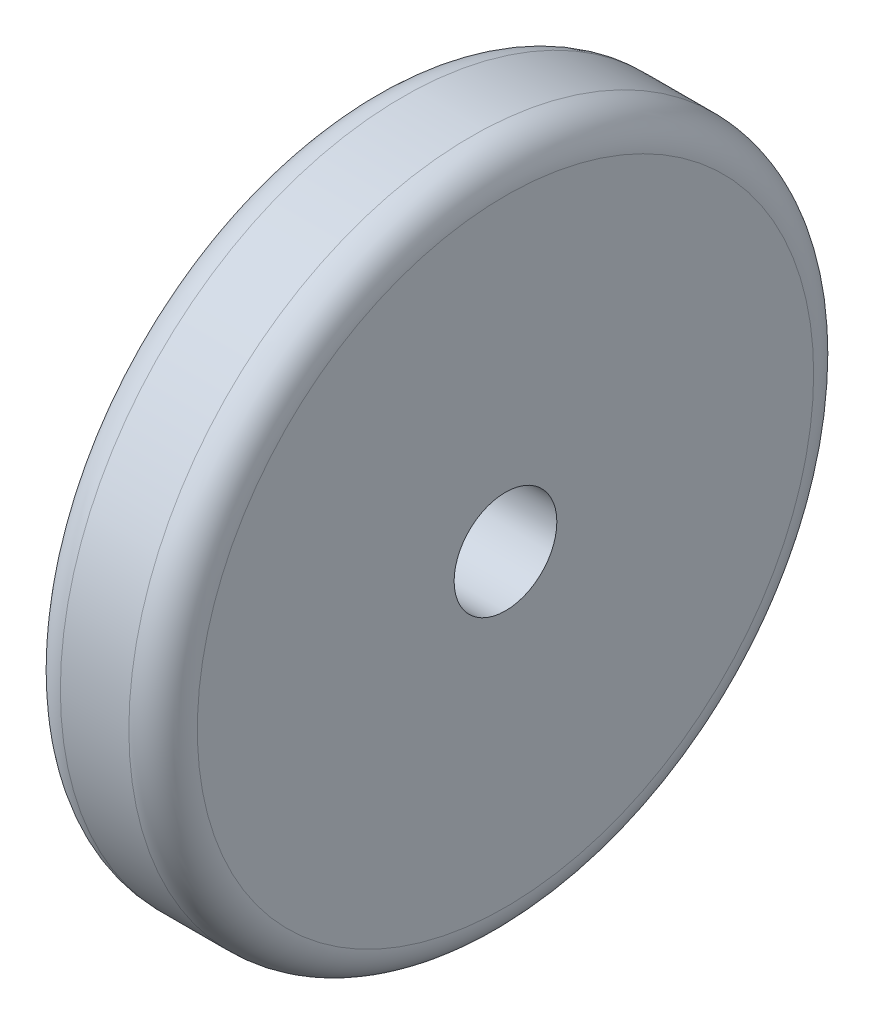
ISO-10303-21;
HEADER;
FILE_DESCRIPTION(('STEP AP214'),'2;1');
FILE_NAME('part.step','',(''),(''),'','','');
FILE_SCHEMA(('AUTOMOTIVE_DESIGN { 1 0 10303 214 1 1 1 1 }'));
ENDSEC;
DATA;
#1=APPLICATION_CONTEXT('core data for automotive mechanical design processes');
#2=APPLICATION_PROTOCOL_DEFINITION('international standard','automotive_design',2000,#1);
#3=PRODUCT_CONTEXT('',#1,'mechanical');
#4=PRODUCT('Part','Part','',(#3));
#5=PRODUCT_RELATED_PRODUCT_CATEGORY('part','',(#4));
#6=PRODUCT_DEFINITION_FORMATION('','',#4);
#7=PRODUCT_DEFINITION_CONTEXT('part definition',#1,'design');
#8=PRODUCT_DEFINITION('design','',#6,#7);
#9=PRODUCT_DEFINITION_SHAPE('','',#8);
#10=(LENGTH_UNIT() NAMED_UNIT(*) SI_UNIT(.MILLI.,.METRE.));
#11=(NAMED_UNIT(*) PLANE_ANGLE_UNIT() SI_UNIT($,.RADIAN.));
#12=(NAMED_UNIT(*) SI_UNIT($,.STERADIAN.) SOLID_ANGLE_UNIT());
#13=UNCERTAINTY_MEASURE_WITH_UNIT(LENGTH_MEASURE(1.E-05),#10,'distance_accuracy_value','');
#14=(GEOMETRIC_REPRESENTATION_CONTEXT(3) GLOBAL_UNCERTAINTY_ASSIGNED_CONTEXT((#13)) GLOBAL_UNIT_ASSIGNED_CONTEXT((#10,
#11,#12)) REPRESENTATION_CONTEXT('',''));
#15=CARTESIAN_POINT('',(0.,0.,0.));
#16=DIRECTION('',(0.,0.,1.));
#17=DIRECTION('',(1.,0.,0.));
#18=AXIS2_PLACEMENT_3D('',#15,#16,#17);
#19=CARTESIAN_POINT('',(20.,0.,0.));
#20=DIRECTION('',(-1.,0.,0.));
#21=DIRECTION('',(0.,0.,1.));
#22=AXIS2_PLACEMENT_3D('',#19,#20,#21);
#23=CYLINDRICAL_SURFACE('',#22,50.);
#24=CARTESIAN_POINT('',(5.,0.,0.));
#25=DIRECTION('',(1.,0.,0.));
#26=DIRECTION('',(0.,0.,-1.));
#27=AXIS2_PLACEMENT_3D('',#24,#25,#26);
#28=CIRCLE('',#27,50.);
#29=CARTESIAN_POINT('',(5.,0.,-50.));
#30=VERTEX_POINT('',#29);
#31=EDGE_CURVE('E48',#30,#30,#28,.T.);
#32=ORIENTED_EDGE('',*,*,#31,.T.);
#33=EDGE_LOOP('',(#32));
#34=FACE_BOUND('',#33,.T.);
#35=CARTESIAN_POINT('',(15.,0.,0.));
#36=DIRECTION('',(1.,0.,0.));
#37=DIRECTION('',(0.,0.,-1.));
#38=AXIS2_PLACEMENT_3D('',#35,#36,#37);
#39=CIRCLE('',#38,50.);
#40=CARTESIAN_POINT('',(15.,0.,-50.));
#41=VERTEX_POINT('',#40);
#42=EDGE_CURVE('E52',#41,#41,#39,.F.);
#43=ORIENTED_EDGE('',*,*,#42,.T.);
#44=EDGE_LOOP('',(#43));
#45=FACE_BOUND('',#44,.T.);
#46=ADVANCED_FACE('F37',(#34,#45),#23,.T.);
#47=CARTESIAN_POINT('',(20.,0.,0.));
#48=DIRECTION('',(1.,0.,0.));
#49=DIRECTION('',(0.,0.,-1.));
#50=AXIS2_PLACEMENT_3D('',#47,#48,#49);
#51=PLANE('',#50);
#52=CARTESIAN_POINT('',(20.,0.,0.));
#53=DIRECTION('',(1.,0.,0.));
#54=DIRECTION('',(0.,0.,-1.));
#55=AXIS2_PLACEMENT_3D('',#52,#53,#54);
#56=CIRCLE('',#55,7.5);
#57=CARTESIAN_POINT('',(20.,0.,-7.5));
#58=VERTEX_POINT('',#57);
#59=EDGE_CURVE('E57',#58,#58,#56,.T.);
#60=ORIENTED_EDGE('',*,*,#59,.F.);
#61=EDGE_LOOP('',(#60));
#62=FACE_BOUND('',#61,.T.);
#63=CARTESIAN_POINT('',(20.,0.,0.));
#64=DIRECTION('',(1.,0.,0.));
#65=DIRECTION('',(0.,0.,-1.));
#66=AXIS2_PLACEMENT_3D('',#63,#64,#65);
#67=CIRCLE('',#66,45.);
#68=CARTESIAN_POINT('',(20.,0.,-45.));
#69=VERTEX_POINT('',#68);
#70=EDGE_CURVE('E10',#69,#69,#67,.T.);
#71=ORIENTED_EDGE('',*,*,#70,.T.);
#72=EDGE_LOOP('',(#71));
#73=FACE_BOUND('',#72,.T.);
#74=ADVANCED_FACE('F69',(#62,#73),#51,.T.);
#75=CARTESIAN_POINT('',(0.,0.,0.));
#76=DIRECTION('',(1.,0.,0.));
#77=DIRECTION('',(0.,0.,-1.));
#78=AXIS2_PLACEMENT_3D('',#75,#76,#77);
#79=PLANE('',#78);
#80=CARTESIAN_POINT('',(0.,0.,0.));
#81=DIRECTION('',(-1.,0.,0.));
#82=DIRECTION('',(0.,0.,1.));
#83=AXIS2_PLACEMENT_3D('',#80,#81,#82);
#84=CIRCLE('',#83,7.5);
#85=CARTESIAN_POINT('',(0.,0.,7.5));
#86=VERTEX_POINT('',#85);
#87=EDGE_CURVE('E60',#86,#86,#84,.T.);
#88=ORIENTED_EDGE('',*,*,#87,.F.);
#89=EDGE_LOOP('',(#88));
#90=FACE_BOUND('',#89,.T.);
#91=CARTESIAN_POINT('',(0.,0.,0.));
#92=DIRECTION('',(1.,0.,0.));
#93=DIRECTION('',(0.,0.,-1.));
#94=AXIS2_PLACEMENT_3D('',#91,#92,#93);
#95=CIRCLE('',#94,45.);
#96=CARTESIAN_POINT('',(0.,0.,-45.));
#97=VERTEX_POINT('',#96);
#98=EDGE_CURVE('E44',#97,#97,#95,.F.);
#99=ORIENTED_EDGE('',*,*,#98,.T.);
#100=EDGE_LOOP('',(#99));
#101=FACE_BOUND('',#100,.T.);
#102=ADVANCED_FACE('F66',(#90,#101),#79,.F.);
#103=CARTESIAN_POINT('',(5.,0.,0.));
#104=DIRECTION('',(1.,0.,0.));
#105=DIRECTION('',(0.,0.,-1.));
#106=AXIS2_PLACEMENT_3D('',#103,#104,#105);
#107=TOROIDAL_SURFACE('',#106,45.,5.);
#108=ORIENTED_EDGE('',*,*,#98,.F.);
#109=EDGE_LOOP('',(#108));
#110=FACE_BOUND('',#109,.T.);
#111=ORIENTED_EDGE('',*,*,#31,.F.);
#112=EDGE_LOOP('',(#111));
#113=FACE_BOUND('',#112,.T.);
#114=ADVANCED_FACE('F68',(#110,#113),#107,.T.);
#115=CARTESIAN_POINT('',(15.,0.,0.));
#116=DIRECTION('',(1.,0.,0.));
#117=DIRECTION('',(0.,0.,-1.));
#118=AXIS2_PLACEMENT_3D('',#115,#116,#117);
#119=TOROIDAL_SURFACE('',#118,45.,5.);
#120=ORIENTED_EDGE('',*,*,#42,.F.);
#121=EDGE_LOOP('',(#120));
#122=FACE_BOUND('',#121,.T.);
#123=ORIENTED_EDGE('',*,*,#70,.F.);
#124=EDGE_LOOP('',(#123));
#125=FACE_BOUND('',#124,.T.);
#126=ADVANCED_FACE('F39',(#122,#125),#119,.T.);
#127=CARTESIAN_POINT('',(30.,0.,0.));
#128=DIRECTION('',(-1.,0.,0.));
#129=DIRECTION('',(0.,0.,1.));
#130=AXIS2_PLACEMENT_3D('',#127,#128,#129);
#131=CYLINDRICAL_SURFACE('',#130,7.5);
#132=ORIENTED_EDGE('',*,*,#59,.T.);
#133=EDGE_LOOP('',(#132));
#134=FACE_BOUND('',#133,.T.);
#135=ORIENTED_EDGE('',*,*,#87,.T.);
#136=EDGE_LOOP('',(#135));
#137=FACE_BOUND('',#136,.T.);
#138=ADVANCED_FACE('F64',(#134,#137),#131,.F.);
#139=CLOSED_SHELL('',(#46,#74,#102,#114,#126,#138));
#140=MANIFOLD_SOLID_BREP('B2',#139);
#141=ADVANCED_BREP_SHAPE_REPRESENTATION('',(#18,#140),#14);
#142=SHAPE_DEFINITION_REPRESENTATION(#9,#141);
ENDSEC;
END-ISO-10303-21;
